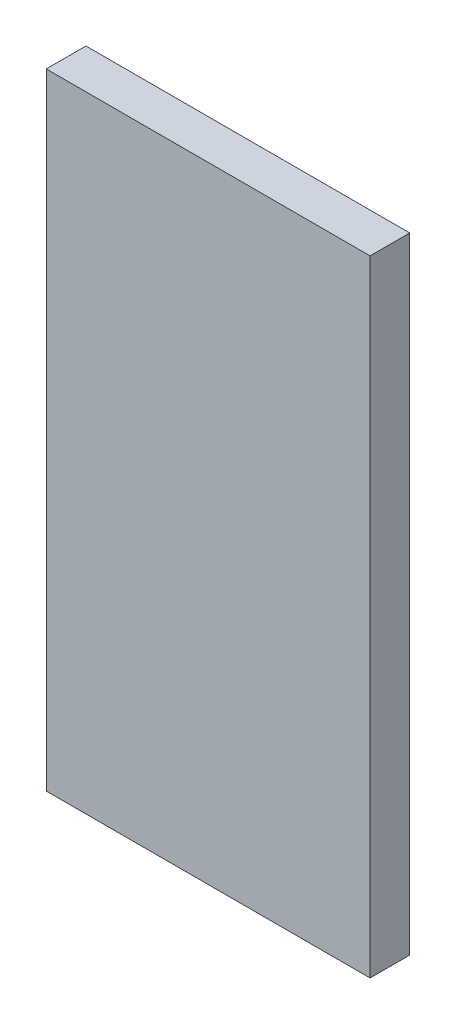
ISO-10303-21;
HEADER;
FILE_DESCRIPTION(('STEP AP214'),'2;1');
FILE_NAME('part.step','',(''),(''),'','','');
FILE_SCHEMA(('AUTOMOTIVE_DESIGN { 1 0 10303 214 1 1 1 1 }'));
ENDSEC;
DATA;
#1=APPLICATION_CONTEXT('core data for automotive mechanical design processes');
#2=APPLICATION_PROTOCOL_DEFINITION('international standard','automotive_design',2000,#1);
#3=PRODUCT_CONTEXT('',#1,'mechanical');
#4=PRODUCT('Part','Part','',(#3));
#5=PRODUCT_RELATED_PRODUCT_CATEGORY('part','',(#4));
#6=PRODUCT_DEFINITION_FORMATION('','',#4);
#7=PRODUCT_DEFINITION_CONTEXT('part definition',#1,'design');
#8=PRODUCT_DEFINITION('design','',#6,#7);
#9=PRODUCT_DEFINITION_SHAPE('','',#8);
#10=(LENGTH_UNIT() NAMED_UNIT(*) SI_UNIT(.MILLI.,.METRE.));
#11=(NAMED_UNIT(*) PLANE_ANGLE_UNIT() SI_UNIT($,.RADIAN.));
#12=(NAMED_UNIT(*) SI_UNIT($,.STERADIAN.) SOLID_ANGLE_UNIT());
#13=UNCERTAINTY_MEASURE_WITH_UNIT(LENGTH_MEASURE(1.E-05),#10,'distance_accuracy_value','');
#14=(GEOMETRIC_REPRESENTATION_CONTEXT(3) GLOBAL_UNCERTAINTY_ASSIGNED_CONTEXT((#13)) GLOBAL_UNIT_ASSIGNED_CONTEXT((#10,
#11,#12)) REPRESENTATION_CONTEXT('',''));
#15=CARTESIAN_POINT('',(0.,0.,0.));
#16=DIRECTION('',(0.,0.,1.));
#17=DIRECTION('',(1.,0.,0.));
#18=AXIS2_PLACEMENT_3D('',#15,#16,#17);
#19=CARTESIAN_POINT('',(7.212,-3.698,0.1));
#20=DIRECTION('',(0.,0.,1.));
#21=DIRECTION('',(1.,0.,0.));
#22=AXIS2_PLACEMENT_3D('',#19,#20,#21);
#23=PLANE('',#22);
#24=DIRECTION('',(0.,1.,0.));
#25=VECTOR('',#24,1.);
#26=CARTESIAN_POINT('',(8.028,-3.698,0.1));
#27=LINE('',#26,#25);
#28=CARTESIAN_POINT('',(8.028,-2.122,0.1));
#29=VERTEX_POINT('',#28);
#30=CARTESIAN_POINT('',(8.028,-3.698,0.1));
#31=VERTEX_POINT('',#30);
#32=EDGE_CURVE('E75',#29,#31,#27,.F.);
#33=ORIENTED_EDGE('',*,*,#32,.F.);
#34=DIRECTION('',(1.,0.,0.));
#35=VECTOR('',#34,1.);
#36=CARTESIAN_POINT('',(7.212,-2.122,0.1));
#37=LINE('',#36,#35);
#38=CARTESIAN_POINT('',(7.212,-2.122,0.1));
#39=VERTEX_POINT('',#38);
#40=EDGE_CURVE('E57',#39,#29,#37,.T.);
#41=ORIENTED_EDGE('',*,*,#40,.F.);
#42=DIRECTION('',(0.,1.,0.));
#43=VECTOR('',#42,1.);
#44=CARTESIAN_POINT('',(7.212,-3.698,0.1));
#45=LINE('',#44,#43);
#46=CARTESIAN_POINT('',(7.212,-3.698,0.1));
#47=VERTEX_POINT('',#46);
#48=EDGE_CURVE('E19',#39,#47,#45,.F.);
#49=ORIENTED_EDGE('',*,*,#48,.T.);
#50=DIRECTION('',(1.,0.,0.));
#51=VECTOR('',#50,1.);
#52=CARTESIAN_POINT('',(7.212,-3.698,0.1));
#53=LINE('',#52,#51);
#54=EDGE_CURVE('E54',#47,#31,#53,.T.);
#55=ORIENTED_EDGE('',*,*,#54,.T.);
#56=EDGE_LOOP('',(#33,#41,#49,#55));
#57=FACE_BOUND('',#56,.T.);
#58=ADVANCED_FACE('F16',(#57),#23,.T.);
#59=CARTESIAN_POINT('',(7.212,-3.698,0.));
#60=DIRECTION('',(1.,0.,0.));
#61=DIRECTION('',(0.,0.,-1.));
#62=AXIS2_PLACEMENT_3D('',#59,#60,#61);
#63=PLANE('',#62);
#64=DIRECTION('',(0.,0.,1.));
#65=VECTOR('',#64,1.);
#66=CARTESIAN_POINT('',(7.212,-2.122,0.));
#67=LINE('',#66,#65);
#68=CARTESIAN_POINT('',(7.212,-2.122,0.));
#69=VERTEX_POINT('',#68);
#70=EDGE_CURVE('E77',#69,#39,#67,.T.);
#71=ORIENTED_EDGE('',*,*,#70,.F.);
#72=DIRECTION('',(0.,1.,0.));
#73=VECTOR('',#72,1.);
#74=CARTESIAN_POINT('',(7.212,-3.698,0.));
#75=LINE('',#74,#73);
#76=CARTESIAN_POINT('',(7.212,-3.698,0.));
#77=VERTEX_POINT('',#76);
#78=EDGE_CURVE('E72',#69,#77,#75,.F.);
#79=ORIENTED_EDGE('',*,*,#78,.T.);
#80=DIRECTION('',(0.,0.,1.));
#81=VECTOR('',#80,1.);
#82=CARTESIAN_POINT('',(7.212,-3.698,0.));
#83=LINE('',#82,#81);
#84=EDGE_CURVE('E62',#77,#47,#83,.T.);
#85=ORIENTED_EDGE('',*,*,#84,.T.);
#86=ORIENTED_EDGE('',*,*,#48,.F.);
#87=EDGE_LOOP('',(#71,#79,#85,#86));
#88=FACE_BOUND('',#87,.T.);
#89=ADVANCED_FACE('F71',(#88),#63,.F.);
#90=CARTESIAN_POINT('',(7.212,-3.698,0.));
#91=DIRECTION('',(0.,1.,0.));
#92=DIRECTION('',(0.,0.,1.));
#93=AXIS2_PLACEMENT_3D('',#90,#91,#92);
#94=PLANE('',#93);
#95=ORIENTED_EDGE('',*,*,#54,.F.);
#96=ORIENTED_EDGE('',*,*,#84,.F.);
#97=DIRECTION('',(1.,0.,0.));
#98=VECTOR('',#97,1.);
#99=CARTESIAN_POINT('',(7.212,-3.698,0.));
#100=LINE('',#99,#98);
#101=CARTESIAN_POINT('',(8.028,-3.698,0.));
#102=VERTEX_POINT('',#101);
#103=EDGE_CURVE('E82',#77,#102,#100,.T.);
#104=ORIENTED_EDGE('',*,*,#103,.T.);
#105=DIRECTION('',(0.,0.,-1.));
#106=VECTOR('',#105,1.);
#107=CARTESIAN_POINT('',(8.028,-3.698,0.));
#108=LINE('',#107,#106);
#109=EDGE_CURVE('E68',#31,#102,#108,.T.);
#110=ORIENTED_EDGE('',*,*,#109,.F.);
#111=EDGE_LOOP('',(#95,#96,#104,#110));
#112=FACE_BOUND('',#111,.T.);
#113=ADVANCED_FACE('F65',(#112),#94,.F.);
#114=CARTESIAN_POINT('',(8.028,-3.698,0.));
#115=DIRECTION('',(1.,0.,0.));
#116=DIRECTION('',(0.,0.,-1.));
#117=AXIS2_PLACEMENT_3D('',#114,#115,#116);
#118=PLANE('',#117);
#119=DIRECTION('',(0.,0.,1.));
#120=VECTOR('',#119,1.);
#121=CARTESIAN_POINT('',(8.028,-2.122,0.));
#122=LINE('',#121,#120);
#123=CARTESIAN_POINT('',(8.028,-2.122,0.));
#124=VERTEX_POINT('',#123);
#125=EDGE_CURVE('E33',#29,#124,#122,.F.);
#126=ORIENTED_EDGE('',*,*,#125,.F.);
#127=ORIENTED_EDGE('',*,*,#32,.T.);
#128=ORIENTED_EDGE('',*,*,#109,.T.);
#129=DIRECTION('',(0.,1.,0.));
#130=VECTOR('',#129,1.);
#131=CARTESIAN_POINT('',(8.028,-3.698,0.));
#132=LINE('',#131,#130);
#133=EDGE_CURVE('E25',#102,#124,#132,.T.);
#134=ORIENTED_EDGE('',*,*,#133,.T.);
#135=EDGE_LOOP('',(#126,#127,#128,#134));
#136=FACE_BOUND('',#135,.T.);
#137=ADVANCED_FACE('F87',(#136),#118,.T.);
#138=CARTESIAN_POINT('',(7.212,-2.122,0.));
#139=DIRECTION('',(0.,1.,0.));
#140=DIRECTION('',(0.,0.,1.));
#141=AXIS2_PLACEMENT_3D('',#138,#139,#140);
#142=PLANE('',#141);
#143=ORIENTED_EDGE('',*,*,#40,.T.);
#144=ORIENTED_EDGE('',*,*,#125,.T.);
#145=DIRECTION('',(1.,0.,0.));
#146=VECTOR('',#145,1.);
#147=CARTESIAN_POINT('',(7.212,-2.122,0.));
#148=LINE('',#147,#146);
#149=EDGE_CURVE('E11',#124,#69,#148,.F.);
#150=ORIENTED_EDGE('',*,*,#149,.T.);
#151=ORIENTED_EDGE('',*,*,#70,.T.);
#152=EDGE_LOOP('',(#143,#144,#150,#151));
#153=FACE_BOUND('',#152,.T.);
#154=ADVANCED_FACE('F90',(#153),#142,.T.);
#155=CARTESIAN_POINT('',(7.212,-3.698,0.));
#156=DIRECTION('',(0.,0.,1.));
#157=DIRECTION('',(1.,0.,0.));
#158=AXIS2_PLACEMENT_3D('',#155,#156,#157);
#159=PLANE('',#158);
#160=ORIENTED_EDGE('',*,*,#133,.F.);
#161=ORIENTED_EDGE('',*,*,#103,.F.);
#162=ORIENTED_EDGE('',*,*,#78,.F.);
#163=ORIENTED_EDGE('',*,*,#149,.F.);
#164=EDGE_LOOP('',(#160,#161,#162,#163));
#165=FACE_BOUND('',#164,.T.);
#166=ADVANCED_FACE('F89',(#165),#159,.F.);
#167=CLOSED_SHELL('',(#58,#89,#113,#137,#154,#166));
#168=MANIFOLD_SOLID_BREP('B1',#167);
#169=ADVANCED_BREP_SHAPE_REPRESENTATION('',(#18,#168),#14);
#170=SHAPE_DEFINITION_REPRESENTATION(#9,#169);
ENDSEC;
END-ISO-10303-21;
